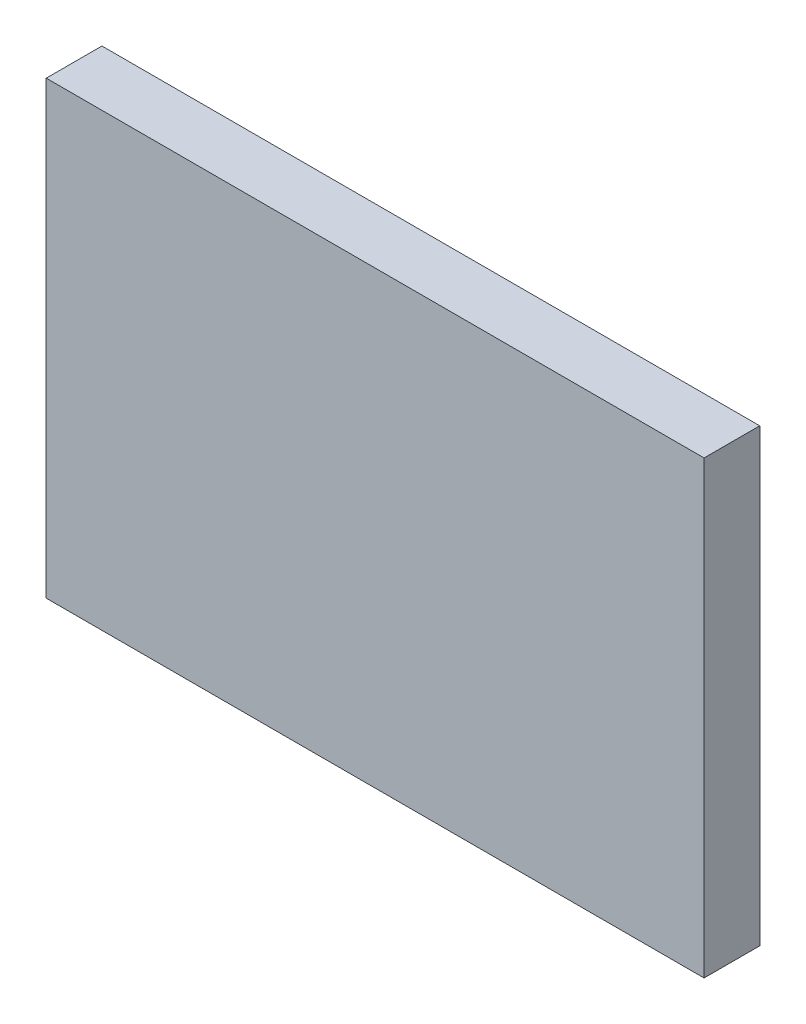
ISO-10303-21;
HEADER;
FILE_DESCRIPTION(('STEP AP214'),'2;1');
FILE_NAME('part.step','',(''),(''),'','','');
FILE_SCHEMA(('AUTOMOTIVE_DESIGN { 1 0 10303 214 1 1 1 1 }'));
ENDSEC;
DATA;
#1=APPLICATION_CONTEXT('core data for automotive mechanical design processes');
#2=APPLICATION_PROTOCOL_DEFINITION('international standard','automotive_design',2000,#1);
#3=PRODUCT_CONTEXT('',#1,'mechanical');
#4=PRODUCT('Part','Part','',(#3));
#5=PRODUCT_RELATED_PRODUCT_CATEGORY('part','',(#4));
#6=PRODUCT_DEFINITION_FORMATION('','',#4);
#7=PRODUCT_DEFINITION_CONTEXT('part definition',#1,'design');
#8=PRODUCT_DEFINITION('design','',#6,#7);
#9=PRODUCT_DEFINITION_SHAPE('','',#8);
#10=(LENGTH_UNIT() NAMED_UNIT(*) SI_UNIT(.MILLI.,.METRE.));
#11=(NAMED_UNIT(*) PLANE_ANGLE_UNIT() SI_UNIT($,.RADIAN.));
#12=(NAMED_UNIT(*) SI_UNIT($,.STERADIAN.) SOLID_ANGLE_UNIT());
#13=UNCERTAINTY_MEASURE_WITH_UNIT(LENGTH_MEASURE(1.E-05),#10,'distance_accuracy_value','');
#14=(GEOMETRIC_REPRESENTATION_CONTEXT(3) GLOBAL_UNCERTAINTY_ASSIGNED_CONTEXT((#13)) GLOBAL_UNIT_ASSIGNED_CONTEXT((#10,
#11,#12)) REPRESENTATION_CONTEXT('',''));
#15=CARTESIAN_POINT('',(0.,0.,0.));
#16=DIRECTION('',(0.,0.,1.));
#17=DIRECTION('',(1.,0.,0.));
#18=AXIS2_PLACEMENT_3D('',#15,#16,#17);
#19=CARTESIAN_POINT('',(0.,0.,6.35));
#20=DIRECTION('',(1.,0.,0.));
#21=DIRECTION('',(0.,0.,-1.));
#22=AXIS2_PLACEMENT_3D('',#19,#20,#21);
#23=PLANE('',#22);
#24=DIRECTION('',(0.,-1.,0.));
#25=VECTOR('',#24,1.);
#26=CARTESIAN_POINT('',(0.,0.,0.));
#27=LINE('',#26,#25);
#28=CARTESIAN_POINT('',(0.,51.35,0.));
#29=VERTEX_POINT('',#28);
#30=CARTESIAN_POINT('',(0.,0.,0.));
#31=VERTEX_POINT('',#30);
#32=EDGE_CURVE('E107',#29,#31,#27,.T.);
#33=ORIENTED_EDGE('',*,*,#32,.T.);
#34=DIRECTION('',(0.,0.,-1.));
#35=VECTOR('',#34,1.);
#36=CARTESIAN_POINT('',(0.,0.,6.35));
#37=LINE('',#36,#35);
#38=CARTESIAN_POINT('',(0.,0.,6.35));
#39=VERTEX_POINT('',#38);
#40=EDGE_CURVE('E11',#39,#31,#37,.T.);
#41=ORIENTED_EDGE('',*,*,#40,.F.);
#42=DIRECTION('',(0.,-1.,0.));
#43=VECTOR('',#42,1.);
#44=CARTESIAN_POINT('',(0.,0.,6.35));
#45=LINE('',#44,#43);
#46=CARTESIAN_POINT('',(0.,51.35,6.35));
#47=VERTEX_POINT('',#46);
#48=EDGE_CURVE('E91',#47,#39,#45,.T.);
#49=ORIENTED_EDGE('',*,*,#48,.F.);
#50=DIRECTION('',(0.,0.,-1.));
#51=VECTOR('',#50,1.);
#52=CARTESIAN_POINT('',(0.,51.35,6.35));
#53=LINE('',#52,#51);
#54=EDGE_CURVE('E103',#47,#29,#53,.T.);
#55=ORIENTED_EDGE('',*,*,#54,.T.);
#56=EDGE_LOOP('',(#33,#41,#49,#55));
#57=FACE_BOUND('',#56,.T.);
#58=ADVANCED_FACE('F39',(#57),#23,.F.);
#59=CARTESIAN_POINT('',(0.,0.,6.35));
#60=DIRECTION('',(0.,1.,0.));
#61=DIRECTION('',(0.,0.,1.));
#62=AXIS2_PLACEMENT_3D('',#59,#60,#61);
#63=PLANE('',#62);
#64=DIRECTION('',(1.,0.,0.));
#65=VECTOR('',#64,1.);
#66=CARTESIAN_POINT('',(0.,0.,0.));
#67=LINE('',#66,#65);
#68=CARTESIAN_POINT('',(75.,0.,0.));
#69=VERTEX_POINT('',#68);
#70=EDGE_CURVE('E96',#31,#69,#67,.T.);
#71=ORIENTED_EDGE('',*,*,#70,.T.);
#72=DIRECTION('',(0.,0.,-1.));
#73=VECTOR('',#72,1.);
#74=CARTESIAN_POINT('',(75.,0.,6.35));
#75=LINE('',#74,#73);
#76=CARTESIAN_POINT('',(75.,0.,6.35));
#77=VERTEX_POINT('',#76);
#78=EDGE_CURVE('E48',#77,#69,#75,.T.);
#79=ORIENTED_EDGE('',*,*,#78,.F.);
#80=DIRECTION('',(1.,0.,0.));
#81=VECTOR('',#80,1.);
#82=CARTESIAN_POINT('',(0.,0.,6.35));
#83=LINE('',#82,#81);
#84=EDGE_CURVE('E86',#39,#77,#83,.T.);
#85=ORIENTED_EDGE('',*,*,#84,.F.);
#86=ORIENTED_EDGE('',*,*,#40,.T.);
#87=EDGE_LOOP('',(#71,#79,#85,#86));
#88=FACE_BOUND('',#87,.T.);
#89=ADVANCED_FACE('F95',(#88),#63,.F.);
#90=CARTESIAN_POINT('',(75.,0.,6.35));
#91=DIRECTION('',(-1.,0.,0.));
#92=DIRECTION('',(0.,0.,1.));
#93=AXIS2_PLACEMENT_3D('',#90,#91,#92);
#94=PLANE('',#93);
#95=DIRECTION('',(0.,1.,0.));
#96=VECTOR('',#95,1.);
#97=CARTESIAN_POINT('',(75.,0.,0.));
#98=LINE('',#97,#96);
#99=CARTESIAN_POINT('',(75.,51.35,0.));
#100=VERTEX_POINT('',#99);
#101=EDGE_CURVE('E73',#69,#100,#98,.T.);
#102=ORIENTED_EDGE('',*,*,#101,.T.);
#103=DIRECTION('',(0.,0.,-1.));
#104=VECTOR('',#103,1.);
#105=CARTESIAN_POINT('',(75.,51.35,6.35));
#106=LINE('',#105,#104);
#107=CARTESIAN_POINT('',(75.,51.35,6.35));
#108=VERTEX_POINT('',#107);
#109=EDGE_CURVE('E98',#108,#100,#106,.T.);
#110=ORIENTED_EDGE('',*,*,#109,.F.);
#111=DIRECTION('',(0.,1.,0.));
#112=VECTOR('',#111,1.);
#113=CARTESIAN_POINT('',(75.,0.,6.35));
#114=LINE('',#113,#112);
#115=EDGE_CURVE('E89',#77,#108,#114,.T.);
#116=ORIENTED_EDGE('',*,*,#115,.F.);
#117=ORIENTED_EDGE('',*,*,#78,.T.);
#118=EDGE_LOOP('',(#102,#110,#116,#117));
#119=FACE_BOUND('',#118,.T.);
#120=ADVANCED_FACE('F99',(#119),#94,.F.);
#121=CARTESIAN_POINT('',(0.,51.35,6.35));
#122=DIRECTION('',(0.,-1.,0.));
#123=DIRECTION('',(0.,0.,-1.));
#124=AXIS2_PLACEMENT_3D('',#121,#122,#123);
#125=PLANE('',#124);
#126=DIRECTION('',(-1.,0.,0.));
#127=VECTOR('',#126,1.);
#128=CARTESIAN_POINT('',(0.,51.35,0.));
#129=LINE('',#128,#127);
#130=EDGE_CURVE('E79',#100,#29,#129,.T.);
#131=ORIENTED_EDGE('',*,*,#130,.T.);
#132=ORIENTED_EDGE('',*,*,#54,.F.);
#133=DIRECTION('',(-1.,0.,0.));
#134=VECTOR('',#133,1.);
#135=CARTESIAN_POINT('',(0.,51.35,6.35));
#136=LINE('',#135,#134);
#137=EDGE_CURVE('E56',#108,#47,#136,.T.);
#138=ORIENTED_EDGE('',*,*,#137,.F.);
#139=ORIENTED_EDGE('',*,*,#109,.T.);
#140=EDGE_LOOP('',(#131,#132,#138,#139));
#141=FACE_BOUND('',#140,.T.);
#142=ADVANCED_FACE('F120',(#141),#125,.F.);
#143=CARTESIAN_POINT('',(0.,0.,6.35));
#144=DIRECTION('',(0.,0.,-1.));
#145=DIRECTION('',(-1.,0.,0.));
#146=AXIS2_PLACEMENT_3D('',#143,#144,#145);
#147=PLANE('',#146);
#148=ORIENTED_EDGE('',*,*,#48,.T.);
#149=ORIENTED_EDGE('',*,*,#84,.T.);
#150=ORIENTED_EDGE('',*,*,#115,.T.);
#151=ORIENTED_EDGE('',*,*,#137,.T.);
#152=EDGE_LOOP('',(#148,#149,#150,#151));
#153=FACE_BOUND('',#152,.T.);
#154=ADVANCED_FACE('F87',(#153),#147,.F.);
#155=CARTESIAN_POINT('',(0.,0.,0.));
#156=DIRECTION('',(0.,0.,-1.));
#157=DIRECTION('',(-1.,0.,0.));
#158=AXIS2_PLACEMENT_3D('',#155,#156,#157);
#159=PLANE('',#158);
#160=ORIENTED_EDGE('',*,*,#32,.F.);
#161=ORIENTED_EDGE('',*,*,#130,.F.);
#162=ORIENTED_EDGE('',*,*,#101,.F.);
#163=ORIENTED_EDGE('',*,*,#70,.F.);
#164=EDGE_LOOP('',(#160,#161,#162,#163));
#165=FACE_BOUND('',#164,.T.);
#166=ADVANCED_FACE('F123',(#165),#159,.T.);
#167=CLOSED_SHELL('',(#58,#89,#120,#142,#154,#166));
#168=MANIFOLD_SOLID_BREP('B2',#167);
#169=ADVANCED_BREP_SHAPE_REPRESENTATION('',(#18,#168),#14);
#170=SHAPE_DEFINITION_REPRESENTATION(#9,#169);
ENDSEC;
END-ISO-10303-21;
